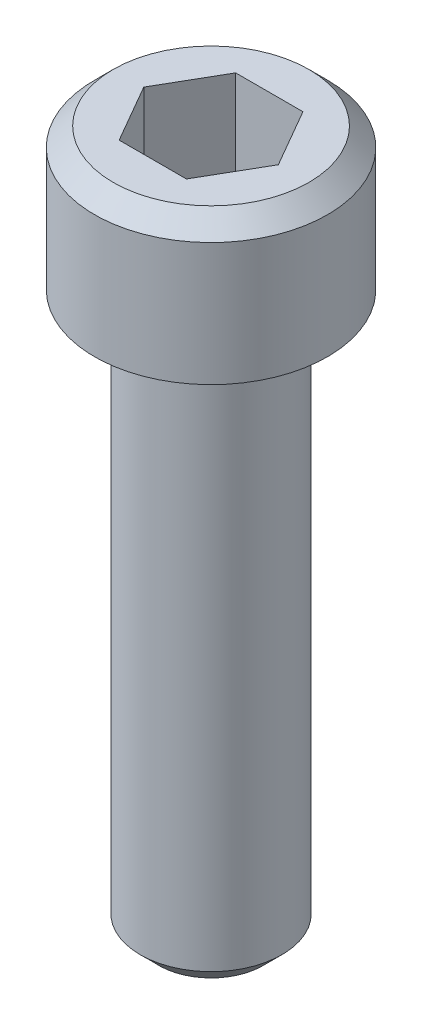
ISO-10303-21;
HEADER;
FILE_DESCRIPTION(('STEP AP214'),'2;1');
FILE_NAME('part.step','',(''),(''),'','','');
FILE_SCHEMA(('AUTOMOTIVE_DESIGN { 1 0 10303 214 1 1 1 1 }'));
ENDSEC;
DATA;
#1=APPLICATION_CONTEXT('core data for automotive mechanical design processes');
#2=APPLICATION_PROTOCOL_DEFINITION('international standard','automotive_design',2000,#1);
#3=PRODUCT_CONTEXT('',#1,'mechanical');
#4=PRODUCT('Part','Part','',(#3));
#5=PRODUCT_RELATED_PRODUCT_CATEGORY('part','',(#4));
#6=PRODUCT_DEFINITION_FORMATION('','',#4);
#7=PRODUCT_DEFINITION_CONTEXT('part definition',#1,'design');
#8=PRODUCT_DEFINITION('design','',#6,#7);
#9=PRODUCT_DEFINITION_SHAPE('','',#8);
#10=(LENGTH_UNIT() NAMED_UNIT(*) SI_UNIT(.MILLI.,.METRE.));
#11=(NAMED_UNIT(*) PLANE_ANGLE_UNIT() SI_UNIT($,.RADIAN.));
#12=(NAMED_UNIT(*) SI_UNIT($,.STERADIAN.) SOLID_ANGLE_UNIT());
#13=UNCERTAINTY_MEASURE_WITH_UNIT(LENGTH_MEASURE(1.E-05),#10,'distance_accuracy_value','');
#14=(GEOMETRIC_REPRESENTATION_CONTEXT(3) GLOBAL_UNCERTAINTY_ASSIGNED_CONTEXT((#13)) GLOBAL_UNIT_ASSIGNED_CONTEXT((#10,
#11,#12)) REPRESENTATION_CONTEXT('',''));
#15=CARTESIAN_POINT('',(0.,0.,0.));
#16=DIRECTION('',(0.,0.,1.));
#17=DIRECTION('',(1.,0.,0.));
#18=AXIS2_PLACEMENT_3D('',#15,#16,#17);
#19=CARTESIAN_POINT('',(-2.291358881,0.,1.984375));
#20=DIRECTION('',(0.,-1.,0.));
#21=DIRECTION('',(0.,0.,-1.));
#22=AXIS2_PLACEMENT_3D('',#19,#20,#21);
#23=PLANE('',#22);
#24=DIRECTION('',(0.500000000188808,0.,-0.86602540367543));
#25=VECTOR('',#24,1.);
#26=CARTESIAN_POINT('',(-1.7185191605,0.,-0.9921875));
#27=LINE('',#26,#25);
#28=CARTESIAN_POINT('',(-2.29135888067977,0.,5.54649696397208E-10));
#29=VERTEX_POINT('',#28);
#30=CARTESIAN_POINT('',(-1.14567944025,0.,-1.984375));
#31=VERTEX_POINT('',#30);
#32=EDGE_CURVE('E84',#29,#31,#27,.T.);
#33=ORIENTED_EDGE('',*,*,#32,.F.);
#34=DIRECTION('',(-0.500000000188808,0.,-0.86602540367543));
#35=VECTOR('',#34,1.);
#36=CARTESIAN_POINT('',(-1.7185191605,0.,0.9921875));
#37=LINE('',#36,#35);
#38=CARTESIAN_POINT('',(-1.145679440125,0.,1.984375));
#39=VERTEX_POINT('',#38);
#40=EDGE_CURVE('E76',#39,#29,#37,.T.);
#41=ORIENTED_EDGE('',*,*,#40,.F.);
#42=DIRECTION('',(-1.,0.,0.));
#43=VECTOR('',#42,1.);
#44=CARTESIAN_POINT('',(0.,0.,1.984375));
#45=LINE('',#44,#43);
#46=CARTESIAN_POINT('',(1.145679440125,0.,1.984375));
#47=VERTEX_POINT('',#46);
#48=EDGE_CURVE('E110',#47,#39,#45,.T.);
#49=ORIENTED_EDGE('',*,*,#48,.F.);
#50=DIRECTION('',(-0.500000000188808,0.,0.86602540367543));
#51=VECTOR('',#50,1.);
#52=CARTESIAN_POINT('',(1.7185191605,0.,0.9921875));
#53=LINE('',#52,#51);
#54=CARTESIAN_POINT('',(2.29135888067977,0.,-5.54649750607317E-10));
#55=VERTEX_POINT('',#54);
#56=EDGE_CURVE('E106',#55,#47,#53,.T.);
#57=ORIENTED_EDGE('',*,*,#56,.F.);
#58=DIRECTION('',(0.500000000188808,0.,0.86602540367543));
#59=VECTOR('',#58,1.);
#60=CARTESIAN_POINT('',(1.7185191605,0.,-0.9921875));
#61=LINE('',#60,#59);
#62=CARTESIAN_POINT('',(1.145679440125,0.,-1.984375));
#63=VERTEX_POINT('',#62);
#64=EDGE_CURVE('E102',#63,#55,#61,.T.);
#65=ORIENTED_EDGE('',*,*,#64,.F.);
#66=DIRECTION('',(1.,0.,0.));
#67=VECTOR('',#66,1.);
#68=CARTESIAN_POINT('',(0.,0.,-1.984375));
#69=LINE('',#68,#67);
#70=EDGE_CURVE('E86',#31,#63,#69,.T.);
#71=ORIENTED_EDGE('',*,*,#70,.F.);
#72=EDGE_LOOP('',(#33,#41,#49,#57,#65,#71));
#73=FACE_BOUND('',#72,.T.);
#74=ADVANCED_FACE('F17',(#73),#23,.F.);
#75=CARTESIAN_POINT('',(-1.14567944,0.,-1.984375));
#76=DIRECTION('',(0.,0.,1.));
#77=DIRECTION('',(1.,0.,0.));
#78=AXIS2_PLACEMENT_3D('',#75,#76,#77);
#79=PLANE('',#78);
#80=DIRECTION('',(0.,-1.,0.));
#81=VECTOR('',#80,1.);
#82=CARTESIAN_POINT('',(1.14567944,2.413,-1.984375));
#83=LINE('',#82,#81);
#84=CARTESIAN_POINT('',(1.14567943956211,4.826,-1.98437499998476));
#85=VERTEX_POINT('',#84);
#86=EDGE_CURVE('E51',#85,#63,#83,.T.);
#87=ORIENTED_EDGE('',*,*,#86,.F.);
#88=DIRECTION('',(1.,0.,0.));
#89=VECTOR('',#88,1.);
#90=CARTESIAN_POINT('',(0.,4.826,-1.98437499997968));
#91=LINE('',#90,#89);
#92=CARTESIAN_POINT('',(-1.14567943956211,4.826,-1.98437499998476));
#93=VERTEX_POINT('',#92);
#94=EDGE_CURVE('E57',#93,#85,#91,.T.);
#95=ORIENTED_EDGE('',*,*,#94,.F.);
#96=DIRECTION('',(0.,1.,0.));
#97=VECTOR('',#96,1.);
#98=CARTESIAN_POINT('',(-1.14567944,2.413,-1.984375));
#99=LINE('',#98,#97);
#100=EDGE_CURVE('E88',#31,#93,#99,.T.);
#101=ORIENTED_EDGE('',*,*,#100,.F.);
#102=ORIENTED_EDGE('',*,*,#70,.T.);
#103=EDGE_LOOP('',(#87,#95,#101,#102));
#104=FACE_BOUND('',#103,.T.);
#105=ADVANCED_FACE('F183',(#104),#79,.T.);
#106=CARTESIAN_POINT('',(1.14567944,0.,-1.984375));
#107=DIRECTION('',(-0.86602540367543,0.,0.500000000188808));
#108=DIRECTION('',(0.500000000188808,0.,0.86602540367543));
#109=AXIS2_PLACEMENT_3D('',#106,#107,#108);
#110=PLANE('',#109);
#111=DIRECTION('',(0.,-1.,0.));
#112=VECTOR('',#111,1.);
#113=CARTESIAN_POINT('',(2.291358881,2.413,0.));
#114=LINE('',#113,#112);
#115=CARTESIAN_POINT('',(2.2913588791083,4.826,-2.97864980587348E-10));
#116=VERTEX_POINT('',#115);
#117=EDGE_CURVE('E103',#116,#55,#114,.T.);
#118=ORIENTED_EDGE('',*,*,#117,.F.);
#119=DIRECTION('',(0.499999999578674,0.,0.866025404027691));
#120=VECTOR('',#119,1.);
#121=CARTESIAN_POINT('',(1.14567943912422,4.826,-1.98437499997968));
#122=LINE('',#121,#120);
#123=EDGE_CURVE('E21',#85,#116,#122,.T.);
#124=ORIENTED_EDGE('',*,*,#123,.F.);
#125=ORIENTED_EDGE('',*,*,#86,.T.);
#126=ORIENTED_EDGE('',*,*,#64,.T.);
#127=EDGE_LOOP('',(#118,#124,#125,#126));
#128=FACE_BOUND('',#127,.T.);
#129=ADVANCED_FACE('F134',(#128),#110,.T.);
#130=CARTESIAN_POINT('',(2.291358881,0.,0.));
#131=DIRECTION('',(-0.86602540367543,0.,-0.500000000188808));
#132=DIRECTION('',(-0.500000000188808,0.,0.86602540367543));
#133=AXIS2_PLACEMENT_3D('',#130,#131,#132);
#134=PLANE('',#133);
#135=DIRECTION('',(0.,-1.,0.));
#136=VECTOR('',#135,1.);
#137=CARTESIAN_POINT('',(1.14567944,2.413,1.984375));
#138=LINE('',#137,#136);
#139=CARTESIAN_POINT('',(1.14567943956211,4.826,1.98437499998476));
#140=VERTEX_POINT('',#139);
#141=EDGE_CURVE('E107',#140,#47,#138,.T.);
#142=ORIENTED_EDGE('',*,*,#141,.F.);
#143=DIRECTION('',(-0.499999999578674,0.,0.866025404027692));
#144=VECTOR('',#143,1.);
#145=CARTESIAN_POINT('',(2.29135887824844,4.826,0.));
#146=LINE('',#145,#144);
#147=EDGE_CURVE('E125',#116,#140,#146,.T.);
#148=ORIENTED_EDGE('',*,*,#147,.F.);
#149=ORIENTED_EDGE('',*,*,#117,.T.);
#150=ORIENTED_EDGE('',*,*,#56,.T.);
#151=EDGE_LOOP('',(#142,#148,#149,#150));
#152=FACE_BOUND('',#151,.T.);
#153=ADVANCED_FACE('F137',(#152),#134,.T.);
#154=CARTESIAN_POINT('',(1.14567944,0.,1.984375));
#155=DIRECTION('',(0.,0.,-1.));
#156=DIRECTION('',(-1.,0.,0.));
#157=AXIS2_PLACEMENT_3D('',#154,#155,#156);
#158=PLANE('',#157);
#159=DIRECTION('',(0.,-1.,0.));
#160=VECTOR('',#159,1.);
#161=CARTESIAN_POINT('',(-1.14567944,2.413,1.984375));
#162=LINE('',#161,#160);
#163=CARTESIAN_POINT('',(-1.14567943956211,4.826,1.98437499998476));
#164=VERTEX_POINT('',#163);
#165=EDGE_CURVE('E79',#164,#39,#162,.T.);
#166=ORIENTED_EDGE('',*,*,#165,.F.);
#167=DIRECTION('',(-1.,0.,0.));
#168=VECTOR('',#167,1.);
#169=CARTESIAN_POINT('',(0.,4.826,1.98437499997968));
#170=LINE('',#169,#168);
#171=EDGE_CURVE('E97',#140,#164,#170,.T.);
#172=ORIENTED_EDGE('',*,*,#171,.F.);
#173=ORIENTED_EDGE('',*,*,#141,.T.);
#174=ORIENTED_EDGE('',*,*,#48,.T.);
#175=EDGE_LOOP('',(#166,#172,#173,#174));
#176=FACE_BOUND('',#175,.T.);
#177=ADVANCED_FACE('F140',(#176),#158,.T.);
#178=CARTESIAN_POINT('',(-1.14567944,0.,1.984375));
#179=DIRECTION('',(0.86602540367543,0.,-0.500000000188808));
#180=DIRECTION('',(-0.500000000188808,0.,-0.86602540367543));
#181=AXIS2_PLACEMENT_3D('',#178,#179,#180);
#182=PLANE('',#181);
#183=DIRECTION('',(0.,-1.,0.));
#184=VECTOR('',#183,1.);
#185=CARTESIAN_POINT('',(-2.291358881,2.413,0.));
#186=LINE('',#185,#184);
#187=CARTESIAN_POINT('',(-2.2913588791083,4.826,2.97864903465352E-10));
#188=VERTEX_POINT('',#187);
#189=EDGE_CURVE('E36',#188,#29,#186,.T.);
#190=ORIENTED_EDGE('',*,*,#189,.F.);
#191=DIRECTION('',(-0.499999999578674,0.,-0.866025404027691));
#192=VECTOR('',#191,1.);
#193=CARTESIAN_POINT('',(-1.14567943912422,4.826,1.98437499997968));
#194=LINE('',#193,#192);
#195=EDGE_CURVE('E124',#164,#188,#194,.T.);
#196=ORIENTED_EDGE('',*,*,#195,.F.);
#197=ORIENTED_EDGE('',*,*,#165,.T.);
#198=ORIENTED_EDGE('',*,*,#40,.T.);
#199=EDGE_LOOP('',(#190,#196,#197,#198));
#200=FACE_BOUND('',#199,.T.);
#201=ADVANCED_FACE('F78',(#200),#182,.T.);
#202=CARTESIAN_POINT('',(-2.291358881,0.,0.));
#203=DIRECTION('',(0.86602540367543,0.,0.500000000188808));
#204=DIRECTION('',(0.500000000188808,0.,-0.86602540367543));
#205=AXIS2_PLACEMENT_3D('',#202,#203,#204);
#206=PLANE('',#205);
#207=ORIENTED_EDGE('',*,*,#100,.T.);
#208=DIRECTION('',(0.499999999578674,0.,-0.866025404027691));
#209=VECTOR('',#208,1.);
#210=CARTESIAN_POINT('',(-2.29135887824844,4.826,0.));
#211=LINE('',#210,#209);
#212=EDGE_CURVE('E92',#188,#93,#211,.T.);
#213=ORIENTED_EDGE('',*,*,#212,.F.);
#214=ORIENTED_EDGE('',*,*,#189,.T.);
#215=ORIENTED_EDGE('',*,*,#32,.T.);
#216=EDGE_LOOP('',(#207,#213,#214,#215));
#217=FACE_BOUND('',#216,.T.);
#218=ADVANCED_FACE('F90',(#217),#206,.T.);
#219=CARTESIAN_POINT('',(-3.373755,4.826,-3.373755));
#220=DIRECTION('',(0.,1.,0.));
#221=DIRECTION('',(0.,0.,1.));
#222=AXIS2_PLACEMENT_3D('',#219,#220,#221);
#223=PLANE('',#222);
#224=ORIENTED_EDGE('',*,*,#195,.T.);
#225=ORIENTED_EDGE('',*,*,#212,.T.);
#226=ORIENTED_EDGE('',*,*,#94,.T.);
#227=ORIENTED_EDGE('',*,*,#123,.T.);
#228=ORIENTED_EDGE('',*,*,#147,.T.);
#229=ORIENTED_EDGE('',*,*,#171,.T.);
#230=EDGE_LOOP('',(#224,#225,#226,#227,#228,#229));
#231=FACE_BOUND('',#230,.T.);
#232=CARTESIAN_POINT('',(0.,4.826,0.));
#233=DIRECTION('',(0.,-1.,0.));
#234=DIRECTION('',(0.,0.,-1.));
#235=AXIS2_PLACEMENT_3D('',#232,#233,#234);
#236=CIRCLE('',#235,3.33375);
#237=CARTESIAN_POINT('',(0.,4.826,-3.33375));
#238=VERTEX_POINT('',#237);
#239=EDGE_CURVE('E120',#238,#238,#236,.F.);
#240=ORIENTED_EDGE('',*,*,#239,.T.);
#241=EDGE_LOOP('',(#240));
#242=FACE_BOUND('',#241,.T.);
#243=ADVANCED_FACE('F131',(#231,#242),#223,.T.);
#244=CARTESIAN_POINT('',(0.,4.826,0.));
#245=DIRECTION('',(0.,-1.,0.));
#246=DIRECTION('',(0.,0.,-1.));
#247=AXIS2_PLACEMENT_3D('',#244,#245,#246);
#248=CONICAL_SURFACE('',#247,3.33375,0.785398163397449);
#249=ORIENTED_EDGE('',*,*,#239,.F.);
#250=EDGE_LOOP('',(#249));
#251=FACE_BOUND('',#250,.T.);
#252=CARTESIAN_POINT('',(0.,4.191,0.));
#253=DIRECTION('',(0.,-1.,0.));
#254=DIRECTION('',(0.,0.,-1.));
#255=AXIS2_PLACEMENT_3D('',#252,#253,#254);
#256=CIRCLE('',#255,3.96875);
#257=CARTESIAN_POINT('',(0.,4.191,-3.96875));
#258=VERTEX_POINT('',#257);
#259=EDGE_CURVE('E119',#258,#258,#256,.F.);
#260=ORIENTED_EDGE('',*,*,#259,.T.);
#261=EDGE_LOOP('',(#260));
#262=FACE_BOUND('',#261,.T.);
#263=ADVANCED_FACE('F149',(#251,#262),#248,.T.);
#264=CARTESIAN_POINT('',(0.,4.191,0.));
#265=DIRECTION('',(0.,-1.,0.));
#266=DIRECTION('',(0.,0.,-1.));
#267=AXIS2_PLACEMENT_3D('',#264,#265,#266);
#268=CYLINDRICAL_SURFACE('',#267,3.96875);
#269=ORIENTED_EDGE('',*,*,#259,.F.);
#270=EDGE_LOOP('',(#269));
#271=FACE_BOUND('',#270,.T.);
#272=CARTESIAN_POINT('',(0.,0.,0.));
#273=DIRECTION('',(0.,-1.,0.));
#274=DIRECTION('',(0.,0.,-1.));
#275=AXIS2_PLACEMENT_3D('',#272,#273,#274);
#276=CIRCLE('',#275,3.96875);
#277=CARTESIAN_POINT('',(0.,0.,-3.96875));
#278=VERTEX_POINT('',#277);
#279=EDGE_CURVE('E116',#278,#278,#276,.F.);
#280=ORIENTED_EDGE('',*,*,#279,.T.);
#281=EDGE_LOOP('',(#280));
#282=FACE_BOUND('',#281,.T.);
#283=ADVANCED_FACE('F151',(#271,#282),#268,.T.);
#284=CARTESIAN_POINT('',(-1.799336,-19.05,1.799336));
#285=DIRECTION('',(0.,-1.,0.));
#286=DIRECTION('',(0.,0.,-1.));
#287=AXIS2_PLACEMENT_3D('',#284,#285,#286);
#288=PLANE('',#287);
#289=CARTESIAN_POINT('',(0.,-19.05,0.));
#290=DIRECTION('',(0.,1.,0.));
#291=DIRECTION('',(-1.,0.,0.));
#292=AXIS2_PLACEMENT_3D('',#289,#290,#291);
#293=CIRCLE('',#292,1.77799999999999);
#294=CARTESIAN_POINT('',(-1.77799999999999,-19.05,0.));
#295=VERTEX_POINT('',#294);
#296=EDGE_CURVE('E113',#295,#295,#293,.F.);
#297=ORIENTED_EDGE('',*,*,#296,.T.);
#298=EDGE_LOOP('',(#297));
#299=FACE_BOUND('',#298,.T.);
#300=ADVANCED_FACE('F154',(#299),#288,.T.);
#301=CARTESIAN_POINT('',(-4.016375,0.,-4.016375));
#302=DIRECTION('',(0.,1.,0.));
#303=DIRECTION('',(0.,0.,1.));
#304=AXIS2_PLACEMENT_3D('',#301,#302,#303);
#305=PLANE('',#304);
#306=CARTESIAN_POINT('',(0.,0.,0.));
#307=DIRECTION('',(0.,1.,0.));
#308=DIRECTION('',(0.,0.,1.));
#309=AXIS2_PLACEMENT_3D('',#306,#307,#308);
#310=CIRCLE('',#309,2.413);
#311=CARTESIAN_POINT('',(0.,0.,2.413));
#312=VERTEX_POINT('',#311);
#313=EDGE_CURVE('E27',#312,#312,#310,.T.);
#314=ORIENTED_EDGE('',*,*,#313,.T.);
#315=EDGE_LOOP('',(#314));
#316=FACE_BOUND('',#315,.T.);
#317=ORIENTED_EDGE('',*,*,#279,.F.);
#318=EDGE_LOOP('',(#317));
#319=FACE_BOUND('',#318,.T.);
#320=ADVANCED_FACE('F19',(#316,#319),#305,.F.);
#321=CARTESIAN_POINT('',(0.,-19.05,0.));
#322=DIRECTION('',(0.,1.,0.));
#323=DIRECTION('',(-1.,0.,0.));
#324=AXIS2_PLACEMENT_3D('',#321,#322,#323);
#325=CONICAL_SURFACE('',#324,1.778,0.785398163397448);
#326=ORIENTED_EDGE('',*,*,#296,.F.);
#327=EDGE_LOOP('',(#326));
#328=FACE_BOUND('',#327,.T.);
#329=CARTESIAN_POINT('',(0.,-18.415,0.));
#330=DIRECTION('',(0.,1.,0.));
#331=DIRECTION('',(0.,0.,1.));
#332=AXIS2_PLACEMENT_3D('',#329,#330,#331);
#333=CIRCLE('',#332,2.413);
#334=CARTESIAN_POINT('',(0.,-18.415,2.413));
#335=VERTEX_POINT('',#334);
#336=EDGE_CURVE('E11',#335,#335,#333,.F.);
#337=ORIENTED_EDGE('',*,*,#336,.T.);
#338=EDGE_LOOP('',(#337));
#339=FACE_BOUND('',#338,.T.);
#340=ADVANCED_FACE('F159',(#328,#339),#325,.T.);
#341=CARTESIAN_POINT('',(0.,-18.415,0.));
#342=DIRECTION('',(0.,1.,0.));
#343=DIRECTION('',(0.,0.,1.));
#344=AXIS2_PLACEMENT_3D('',#341,#342,#343);
#345=CYLINDRICAL_SURFACE('',#344,2.413);
#346=ORIENTED_EDGE('',*,*,#313,.F.);
#347=EDGE_LOOP('',(#346));
#348=FACE_BOUND('',#347,.T.);
#349=ORIENTED_EDGE('',*,*,#336,.F.);
#350=EDGE_LOOP('',(#349));
#351=FACE_BOUND('',#350,.T.);
#352=ADVANCED_FACE('F166',(#348,#351),#345,.T.);
#353=CLOSED_SHELL('',(#74,#105,#129,#153,#177,#201,#218,#243,#263,#283,#300,#320,#340,#352));
#354=MANIFOLD_SOLID_BREP('B1',#353);
#355=ADVANCED_BREP_SHAPE_REPRESENTATION('',(#18,#354),#14);
#356=SHAPE_DEFINITION_REPRESENTATION(#9,#355);
ENDSEC;
END-ISO-10303-21;
